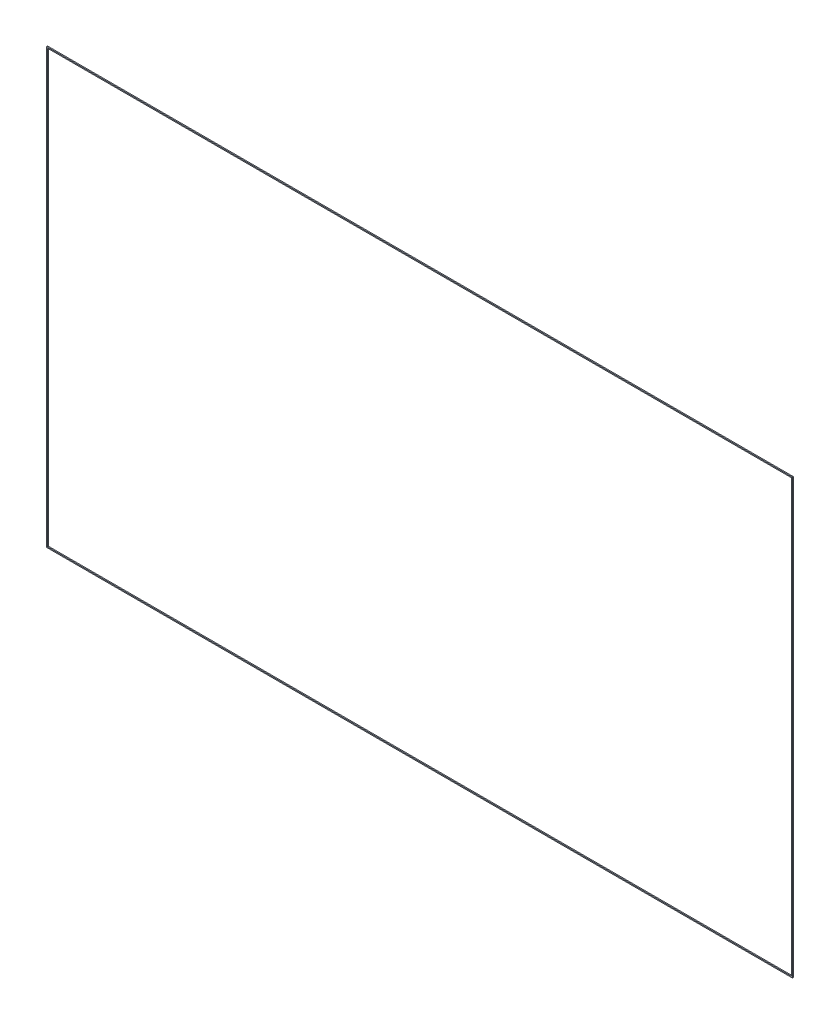
ISO-10303-21;
HEADER;
FILE_DESCRIPTION(('STEP AP214'),'2;1');
FILE_NAME('part.step','',(''),(''),'','','');
FILE_SCHEMA(('AUTOMOTIVE_DESIGN { 1 0 10303 214 1 1 1 1 }'));
ENDSEC;
DATA;
#1=APPLICATION_CONTEXT('core data for automotive mechanical design processes');
#2=APPLICATION_PROTOCOL_DEFINITION('international standard','automotive_design',2000,#1);
#3=PRODUCT_CONTEXT('',#1,'mechanical');
#4=PRODUCT('Part','Part','',(#3));
#5=PRODUCT_RELATED_PRODUCT_CATEGORY('part','',(#4));
#6=PRODUCT_DEFINITION_FORMATION('','',#4);
#7=PRODUCT_DEFINITION_CONTEXT('part definition',#1,'design');
#8=PRODUCT_DEFINITION('design','',#6,#7);
#9=PRODUCT_DEFINITION_SHAPE('','',#8);
#10=(LENGTH_UNIT() NAMED_UNIT(*) SI_UNIT(.MILLI.,.METRE.));
#11=(NAMED_UNIT(*) PLANE_ANGLE_UNIT() SI_UNIT($,.RADIAN.));
#12=(NAMED_UNIT(*) SI_UNIT($,.STERADIAN.) SOLID_ANGLE_UNIT());
#13=UNCERTAINTY_MEASURE_WITH_UNIT(LENGTH_MEASURE(1.E-05),#10,'distance_accuracy_value','');
#14=(GEOMETRIC_REPRESENTATION_CONTEXT(3) GLOBAL_UNCERTAINTY_ASSIGNED_CONTEXT((#13)) GLOBAL_UNIT_ASSIGNED_CONTEXT((#10,
#11,#12)) REPRESENTATION_CONTEXT('',''));
#15=CARTESIAN_POINT('',(0.,0.,0.));
#16=DIRECTION('',(0.,0.,1.));
#17=DIRECTION('',(1.,0.,0.));
#18=AXIS2_PLACEMENT_3D('',#15,#16,#17);
#19=CARTESIAN_POINT('',(191.017368028597,134.099586634191,-39.));
#20=DIRECTION('',(0.,0.,1.));
#21=DIRECTION('',(1.,0.,0.));
#22=AXIS2_PLACEMENT_3D('',#19,#20,#21);
#23=PLANE('',#22);
#24=DIRECTION('',(1.,0.,0.));
#25=VECTOR('',#24,1.);
#26=CARTESIAN_POINT('',(117.017368028597,91.1495866341911,-39.));
#27=LINE('',#26,#25);
#28=CARTESIAN_POINT('',(117.067368028597,91.1495866341911,-39.));
#29=VERTEX_POINT('',#28);
#30=CARTESIAN_POINT('',(190.967368028597,91.1495866341911,-39.));
#31=VERTEX_POINT('',#30);
#32=EDGE_CURVE('E121',#29,#31,#27,.T.);
#33=ORIENTED_EDGE('',*,*,#32,.F.);
#34=DIRECTION('',(0.,1.,0.));
#35=VECTOR('',#34,1.);
#36=CARTESIAN_POINT('',(117.067368028597,134.099586634191,-39.));
#37=LINE('',#36,#35);
#38=CARTESIAN_POINT('',(117.067368028597,134.049586634191,-39.));
#39=VERTEX_POINT('',#38);
#40=EDGE_CURVE('E108',#39,#29,#37,.F.);
#41=ORIENTED_EDGE('',*,*,#40,.F.);
#42=DIRECTION('',(1.,0.,0.));
#43=VECTOR('',#42,1.);
#44=CARTESIAN_POINT('',(191.017368028597,134.049586634191,-39.));
#45=LINE('',#44,#43);
#46=CARTESIAN_POINT('',(190.967368028597,134.049586634191,-39.));
#47=VERTEX_POINT('',#46);
#48=EDGE_CURVE('E110',#47,#39,#45,.F.);
#49=ORIENTED_EDGE('',*,*,#48,.F.);
#50=DIRECTION('',(0.,1.,0.));
#51=VECTOR('',#50,1.);
#52=CARTESIAN_POINT('',(190.967368028597,91.0995866341911,-39.));
#53=LINE('',#52,#51);
#54=EDGE_CURVE('E114',#31,#47,#53,.T.);
#55=ORIENTED_EDGE('',*,*,#54,.F.);
#56=EDGE_LOOP('',(#33,#41,#49,#55));
#57=FACE_BOUND('',#56,.T.);
#58=DIRECTION('',(1.,0.,0.));
#59=VECTOR('',#58,1.);
#60=CARTESIAN_POINT('',(117.017368028597,91.0495866341911,-39.));
#61=LINE('',#60,#59);
#62=CARTESIAN_POINT('',(116.967368028597,91.0495866341911,-39.));
#63=VERTEX_POINT('',#62);
#64=CARTESIAN_POINT('',(191.067368028597,91.0495866341911,-39.));
#65=VERTEX_POINT('',#64);
#66=EDGE_CURVE('E82',#63,#65,#61,.T.);
#67=ORIENTED_EDGE('',*,*,#66,.T.);
#68=DIRECTION('',(0.,1.,0.));
#69=VECTOR('',#68,1.);
#70=CARTESIAN_POINT('',(191.067368028597,91.0995866341911,-39.));
#71=LINE('',#70,#69);
#72=CARTESIAN_POINT('',(191.067368028597,134.149586634191,-39.));
#73=VERTEX_POINT('',#72);
#74=EDGE_CURVE('E20',#65,#73,#71,.T.);
#75=ORIENTED_EDGE('',*,*,#74,.T.);
#76=DIRECTION('',(1.,0.,0.));
#77=VECTOR('',#76,1.);
#78=CARTESIAN_POINT('',(191.017368028597,134.149586634191,-39.));
#79=LINE('',#78,#77);
#80=CARTESIAN_POINT('',(116.967368028597,134.149586634191,-39.));
#81=VERTEX_POINT('',#80);
#82=EDGE_CURVE('E78',#73,#81,#79,.F.);
#83=ORIENTED_EDGE('',*,*,#82,.T.);
#84=DIRECTION('',(0.,1.,0.));
#85=VECTOR('',#84,1.);
#86=CARTESIAN_POINT('',(116.967368028597,134.099586634191,-39.));
#87=LINE('',#86,#85);
#88=EDGE_CURVE('E100',#81,#63,#87,.F.);
#89=ORIENTED_EDGE('',*,*,#88,.T.);
#90=EDGE_LOOP('',(#67,#75,#83,#89));
#91=FACE_BOUND('',#90,.T.);
#92=ADVANCED_FACE('F17',(#57,#91),#23,.T.);
#93=CARTESIAN_POINT('',(191.067368028597,91.0995866341911,-39.));
#94=DIRECTION('',(-1.,0.,0.));
#95=DIRECTION('',(0.,0.,1.));
#96=AXIS2_PLACEMENT_3D('',#93,#94,#95);
#97=PLANE('',#96);
#98=DIRECTION('',(0.,0.,-1.));
#99=VECTOR('',#98,1.);
#100=CARTESIAN_POINT('',(191.067368028597,134.149586634191,-39.));
#101=LINE('',#100,#99);
#102=CARTESIAN_POINT('',(191.067368028597,134.149586634191,-39.1));
#103=VERTEX_POINT('',#102);
#104=EDGE_CURVE('E87',#103,#73,#101,.F.);
#105=ORIENTED_EDGE('',*,*,#104,.T.);
#106=ORIENTED_EDGE('',*,*,#74,.F.);
#107=DIRECTION('',(0.,0.,1.));
#108=VECTOR('',#107,1.);
#109=CARTESIAN_POINT('',(191.067368028597,91.0495866341911,-39.));
#110=LINE('',#109,#108);
#111=CARTESIAN_POINT('',(191.067368028597,91.0495866341911,-39.1));
#112=VERTEX_POINT('',#111);
#113=EDGE_CURVE('E106',#65,#112,#110,.F.);
#114=ORIENTED_EDGE('',*,*,#113,.T.);
#115=DIRECTION('',(0.,1.,0.));
#116=VECTOR('',#115,1.);
#117=CARTESIAN_POINT('',(191.067368028597,91.0995866341911,-39.1));
#118=LINE('',#117,#116);
#119=EDGE_CURVE('E97',#112,#103,#118,.T.);
#120=ORIENTED_EDGE('',*,*,#119,.T.);
#121=EDGE_LOOP('',(#105,#106,#114,#120));
#122=FACE_BOUND('',#121,.T.);
#123=ADVANCED_FACE('F96',(#122),#97,.F.);
#124=CARTESIAN_POINT('',(191.017368028597,134.149586634191,-39.));
#125=DIRECTION('',(0.,-1.,0.));
#126=DIRECTION('',(0.,0.,-1.));
#127=AXIS2_PLACEMENT_3D('',#124,#125,#126);
#128=PLANE('',#127);
#129=DIRECTION('',(0.,0.,1.));
#130=VECTOR('',#129,1.);
#131=CARTESIAN_POINT('',(116.967368028597,134.149586634191,-39.));
#132=LINE('',#131,#130);
#133=CARTESIAN_POINT('',(116.967368028597,134.149586634191,-39.1));
#134=VERTEX_POINT('',#133);
#135=EDGE_CURVE('E93',#134,#81,#132,.T.);
#136=ORIENTED_EDGE('',*,*,#135,.T.);
#137=ORIENTED_EDGE('',*,*,#82,.F.);
#138=ORIENTED_EDGE('',*,*,#104,.F.);
#139=DIRECTION('',(1.,0.,0.));
#140=VECTOR('',#139,1.);
#141=CARTESIAN_POINT('',(117.017368028597,134.149586634191,-39.1));
#142=LINE('',#141,#140);
#143=EDGE_CURVE('E125',#103,#134,#142,.F.);
#144=ORIENTED_EDGE('',*,*,#143,.T.);
#145=EDGE_LOOP('',(#136,#137,#138,#144));
#146=FACE_BOUND('',#145,.T.);
#147=ADVANCED_FACE('F90',(#146),#128,.F.);
#148=CARTESIAN_POINT('',(116.967368028597,134.099586634191,-39.));
#149=DIRECTION('',(1.,0.,0.));
#150=DIRECTION('',(0.,1.,0.));
#151=AXIS2_PLACEMENT_3D('',#148,#149,#150);
#152=PLANE('',#151);
#153=DIRECTION('',(0.,0.,1.));
#154=VECTOR('',#153,1.);
#155=CARTESIAN_POINT('',(116.967368028597,91.0495866341911,-39.));
#156=LINE('',#155,#154);
#157=CARTESIAN_POINT('',(116.967368028597,91.0495866341911,-39.1));
#158=VERTEX_POINT('',#157);
#159=EDGE_CURVE('E102',#158,#63,#156,.T.);
#160=ORIENTED_EDGE('',*,*,#159,.T.);
#161=ORIENTED_EDGE('',*,*,#88,.F.);
#162=ORIENTED_EDGE('',*,*,#135,.F.);
#163=DIRECTION('',(0.,1.,0.));
#164=VECTOR('',#163,1.);
#165=CARTESIAN_POINT('',(116.967368028597,91.0995866341911,-39.1));
#166=LINE('',#165,#164);
#167=EDGE_CURVE('E127',#134,#158,#166,.F.);
#168=ORIENTED_EDGE('',*,*,#167,.T.);
#169=EDGE_LOOP('',(#160,#161,#162,#168));
#170=FACE_BOUND('',#169,.T.);
#171=ADVANCED_FACE('F176',(#170),#152,.F.);
#172=CARTESIAN_POINT('',(117.017368028597,91.0495866341911,-39.));
#173=DIRECTION('',(0.,1.,0.));
#174=DIRECTION('',(0.,0.,1.));
#175=AXIS2_PLACEMENT_3D('',#172,#173,#174);
#176=PLANE('',#175);
#177=ORIENTED_EDGE('',*,*,#113,.F.);
#178=ORIENTED_EDGE('',*,*,#66,.F.);
#179=ORIENTED_EDGE('',*,*,#159,.F.);
#180=DIRECTION('',(1.,0.,0.));
#181=VECTOR('',#180,1.);
#182=CARTESIAN_POINT('',(117.017368028597,91.0495866341911,-39.1));
#183=LINE('',#182,#181);
#184=EDGE_CURVE('E130',#158,#112,#183,.T.);
#185=ORIENTED_EDGE('',*,*,#184,.T.);
#186=EDGE_LOOP('',(#177,#178,#179,#185));
#187=FACE_BOUND('',#186,.T.);
#188=ADVANCED_FACE('F173',(#187),#176,.F.);
#189=CARTESIAN_POINT('',(117.067368028597,134.099586634191,-39.));
#190=DIRECTION('',(1.,0.,0.));
#191=DIRECTION('',(0.,1.,0.));
#192=AXIS2_PLACEMENT_3D('',#189,#190,#191);
#193=PLANE('',#192);
#194=ORIENTED_EDGE('',*,*,#40,.T.);
#195=DIRECTION('',(0.,0.,1.));
#196=VECTOR('',#195,1.);
#197=CARTESIAN_POINT('',(117.067368028597,91.1495866341911,-39.));
#198=LINE('',#197,#196);
#199=CARTESIAN_POINT('',(117.067368028597,91.1495866341911,-39.1));
#200=VERTEX_POINT('',#199);
#201=EDGE_CURVE('E118',#200,#29,#198,.T.);
#202=ORIENTED_EDGE('',*,*,#201,.F.);
#203=DIRECTION('',(0.,1.,0.));
#204=VECTOR('',#203,1.);
#205=CARTESIAN_POINT('',(117.067368028597,91.0995866341911,-39.1));
#206=LINE('',#205,#204);
#207=CARTESIAN_POINT('',(117.067368028597,134.049586634191,-39.1));
#208=VERTEX_POINT('',#207);
#209=EDGE_CURVE('E133',#200,#208,#206,.T.);
#210=ORIENTED_EDGE('',*,*,#209,.T.);
#211=DIRECTION('',(0.,0.,-1.));
#212=VECTOR('',#211,1.);
#213=CARTESIAN_POINT('',(117.067368028597,134.049586634191,-39.));
#214=LINE('',#213,#212);
#215=EDGE_CURVE('E112',#39,#208,#214,.T.);
#216=ORIENTED_EDGE('',*,*,#215,.F.);
#217=EDGE_LOOP('',(#194,#202,#210,#216));
#218=FACE_BOUND('',#217,.T.);
#219=ADVANCED_FACE('F154',(#218),#193,.T.);
#220=CARTESIAN_POINT('',(191.017368028597,134.049586634191,-39.));
#221=DIRECTION('',(0.,-1.,0.));
#222=DIRECTION('',(0.,0.,-1.));
#223=AXIS2_PLACEMENT_3D('',#220,#221,#222);
#224=PLANE('',#223);
#225=ORIENTED_EDGE('',*,*,#48,.T.);
#226=ORIENTED_EDGE('',*,*,#215,.T.);
#227=DIRECTION('',(1.,0.,0.));
#228=VECTOR('',#227,1.);
#229=CARTESIAN_POINT('',(117.017368028597,134.049586634191,-39.1));
#230=LINE('',#229,#228);
#231=CARTESIAN_POINT('',(190.967368028597,134.049586634191,-39.1));
#232=VERTEX_POINT('',#231);
#233=EDGE_CURVE('E136',#208,#232,#230,.T.);
#234=ORIENTED_EDGE('',*,*,#233,.T.);
#235=DIRECTION('',(0.,0.,1.));
#236=VECTOR('',#235,1.);
#237=CARTESIAN_POINT('',(190.967368028597,134.049586634191,-39.));
#238=LINE('',#237,#236);
#239=EDGE_CURVE('E116',#47,#232,#238,.F.);
#240=ORIENTED_EDGE('',*,*,#239,.F.);
#241=EDGE_LOOP('',(#225,#226,#234,#240));
#242=FACE_BOUND('',#241,.T.);
#243=ADVANCED_FACE('F149',(#242),#224,.T.);
#244=CARTESIAN_POINT('',(190.967368028597,91.0995866341911,-39.));
#245=DIRECTION('',(-1.,0.,0.));
#246=DIRECTION('',(0.,0.,1.));
#247=AXIS2_PLACEMENT_3D('',#244,#245,#246);
#248=PLANE('',#247);
#249=ORIENTED_EDGE('',*,*,#54,.T.);
#250=ORIENTED_EDGE('',*,*,#239,.T.);
#251=DIRECTION('',(0.,1.,0.));
#252=VECTOR('',#251,1.);
#253=CARTESIAN_POINT('',(190.967368028597,91.0995866341911,-39.1));
#254=LINE('',#253,#252);
#255=CARTESIAN_POINT('',(190.967368028597,91.1495866341911,-39.1));
#256=VERTEX_POINT('',#255);
#257=EDGE_CURVE('E26',#232,#256,#254,.F.);
#258=ORIENTED_EDGE('',*,*,#257,.T.);
#259=DIRECTION('',(0.,0.,1.));
#260=VECTOR('',#259,1.);
#261=CARTESIAN_POINT('',(190.967368028597,91.1495866341911,-39.));
#262=LINE('',#261,#260);
#263=EDGE_CURVE('E34',#31,#256,#262,.F.);
#264=ORIENTED_EDGE('',*,*,#263,.F.);
#265=EDGE_LOOP('',(#249,#250,#258,#264));
#266=FACE_BOUND('',#265,.T.);
#267=ADVANCED_FACE('F142',(#266),#248,.T.);
#268=CARTESIAN_POINT('',(117.017368028597,91.1495866341911,-39.));
#269=DIRECTION('',(0.,1.,0.));
#270=DIRECTION('',(0.,0.,1.));
#271=AXIS2_PLACEMENT_3D('',#268,#269,#270);
#272=PLANE('',#271);
#273=ORIENTED_EDGE('',*,*,#32,.T.);
#274=ORIENTED_EDGE('',*,*,#263,.T.);
#275=DIRECTION('',(1.,0.,0.));
#276=VECTOR('',#275,1.);
#277=CARTESIAN_POINT('',(117.017368028597,91.1495866341911,-39.1));
#278=LINE('',#277,#276);
#279=EDGE_CURVE('E11',#256,#200,#278,.F.);
#280=ORIENTED_EDGE('',*,*,#279,.T.);
#281=ORIENTED_EDGE('',*,*,#201,.T.);
#282=EDGE_LOOP('',(#273,#274,#280,#281));
#283=FACE_BOUND('',#282,.T.);
#284=ADVANCED_FACE('F157',(#283),#272,.T.);
#285=CARTESIAN_POINT('',(117.017368028597,91.0995866341911,-39.1));
#286=DIRECTION('',(0.,0.,1.));
#287=DIRECTION('',(1.,0.,0.));
#288=AXIS2_PLACEMENT_3D('',#285,#286,#287);
#289=PLANE('',#288);
#290=ORIENTED_EDGE('',*,*,#257,.F.);
#291=ORIENTED_EDGE('',*,*,#233,.F.);
#292=ORIENTED_EDGE('',*,*,#209,.F.);
#293=ORIENTED_EDGE('',*,*,#279,.F.);
#294=EDGE_LOOP('',(#290,#291,#292,#293));
#295=FACE_BOUND('',#294,.T.);
#296=ORIENTED_EDGE('',*,*,#167,.F.);
#297=ORIENTED_EDGE('',*,*,#143,.F.);
#298=ORIENTED_EDGE('',*,*,#119,.F.);
#299=ORIENTED_EDGE('',*,*,#184,.F.);
#300=EDGE_LOOP('',(#296,#297,#298,#299));
#301=FACE_BOUND('',#300,.T.);
#302=ADVANCED_FACE('F146',(#295,#301),#289,.F.);
#303=CLOSED_SHELL('',(#92,#123,#147,#171,#188,#219,#243,#267,#284,#302));
#304=MANIFOLD_SOLID_BREP('B1',#303);
#305=ADVANCED_BREP_SHAPE_REPRESENTATION('',(#18,#304),#14);
#306=SHAPE_DEFINITION_REPRESENTATION(#9,#305);
ENDSEC;
END-ISO-10303-21;
